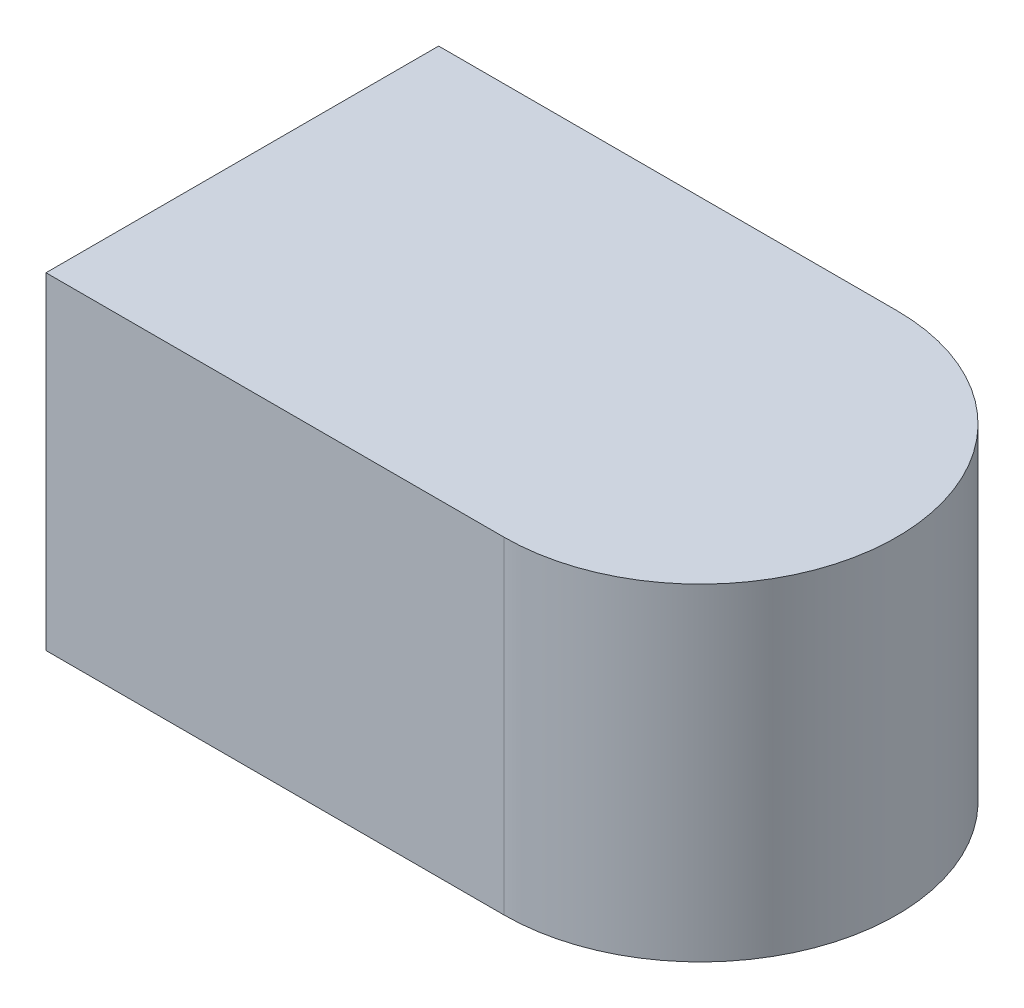
ISO-10303-21;
HEADER;
FILE_DESCRIPTION(('STEP AP214'),'2;1');
FILE_NAME('part.step','',(''),(''),'','','');
FILE_SCHEMA(('AUTOMOTIVE_DESIGN { 1 0 10303 214 1 1 1 1 }'));
ENDSEC;
DATA;
#1=APPLICATION_CONTEXT('core data for automotive mechanical design processes');
#2=APPLICATION_PROTOCOL_DEFINITION('international standard','automotive_design',2000,#1);
#3=PRODUCT_CONTEXT('',#1,'mechanical');
#4=PRODUCT('Part','Part','',(#3));
#5=PRODUCT_RELATED_PRODUCT_CATEGORY('part','',(#4));
#6=PRODUCT_DEFINITION_FORMATION('','',#4);
#7=PRODUCT_DEFINITION_CONTEXT('part definition',#1,'design');
#8=PRODUCT_DEFINITION('design','',#6,#7);
#9=PRODUCT_DEFINITION_SHAPE('','',#8);
#10=(LENGTH_UNIT() NAMED_UNIT(*) SI_UNIT(.MILLI.,.METRE.));
#11=(NAMED_UNIT(*) PLANE_ANGLE_UNIT() SI_UNIT($,.RADIAN.));
#12=(NAMED_UNIT(*) SI_UNIT($,.STERADIAN.) SOLID_ANGLE_UNIT());
#13=UNCERTAINTY_MEASURE_WITH_UNIT(LENGTH_MEASURE(1.E-05),#10,'distance_accuracy_value','');
#14=(GEOMETRIC_REPRESENTATION_CONTEXT(3) GLOBAL_UNCERTAINTY_ASSIGNED_CONTEXT((#13)) GLOBAL_UNIT_ASSIGNED_CONTEXT((#10,
#11,#12)) REPRESENTATION_CONTEXT('',''));
#15=CARTESIAN_POINT('',(0.,0.,0.));
#16=DIRECTION('',(0.,0.,1.));
#17=DIRECTION('',(1.,0.,0.));
#18=AXIS2_PLACEMENT_3D('',#15,#16,#17);
#19=CARTESIAN_POINT('',(0.,0.,0.));
#20=DIRECTION('',(0.,-1.,0.));
#21=DIRECTION('',(-1.,0.,0.));
#22=AXIS2_PLACEMENT_3D('',#19,#20,#21);
#23=PLANE('',#22);
#24=CARTESIAN_POINT('',(-1.47,0.,-0.75));
#25=DIRECTION('',(0.,-1.,0.));
#26=DIRECTION('',(0.,0.,-1.));
#27=AXIS2_PLACEMENT_3D('',#24,#25,#26);
#28=CIRCLE('',#27,0.12);
#29=CARTESIAN_POINT('',(-1.47,0.,-0.87));
#30=VERTEX_POINT('',#29);
#31=CARTESIAN_POINT('',(-1.47,0.,-0.63));
#32=VERTEX_POINT('',#31);
#33=EDGE_CURVE('E11',#30,#32,#28,.T.);
#34=ORIENTED_EDGE('',*,*,#33,.T.);
#35=DIRECTION('',(-1.,0.,0.));
#36=VECTOR('',#35,1.);
#37=CARTESIAN_POINT('',(-1.47,0.,-0.63));
#38=LINE('',#37,#36);
#39=CARTESIAN_POINT('',(-1.75,0.,-0.63));
#40=VERTEX_POINT('',#39);
#41=EDGE_CURVE('E24',#32,#40,#38,.T.);
#42=ORIENTED_EDGE('',*,*,#41,.T.);
#43=DIRECTION('',(0.,0.,-1.));
#44=VECTOR('',#43,1.);
#45=CARTESIAN_POINT('',(-1.75,0.,-0.63));
#46=LINE('',#45,#44);
#47=CARTESIAN_POINT('',(-1.75,0.,-0.87));
#48=VERTEX_POINT('',#47);
#49=EDGE_CURVE('E62',#40,#48,#46,.T.);
#50=ORIENTED_EDGE('',*,*,#49,.T.);
#51=DIRECTION('',(1.,0.,0.));
#52=VECTOR('',#51,1.);
#53=CARTESIAN_POINT('',(-1.75,0.,-0.87));
#54=LINE('',#53,#52);
#55=EDGE_CURVE('E36',#48,#30,#54,.T.);
#56=ORIENTED_EDGE('',*,*,#55,.T.);
#57=EDGE_LOOP('',(#34,#42,#50,#56));
#58=FACE_BOUND('',#57,.T.);
#59=ADVANCED_FACE('F17',(#58),#23,.T.);
#60=CARTESIAN_POINT('',(-1.75,0.,-0.87));
#61=DIRECTION('',(0.,0.,1.));
#62=DIRECTION('',(1.,0.,0.));
#63=AXIS2_PLACEMENT_3D('',#60,#61,#62);
#64=PLANE('',#63);
#65=DIRECTION('',(0.,1.,0.));
#66=VECTOR('',#65,1.);
#67=CARTESIAN_POINT('',(-1.75,0.,-0.87));
#68=LINE('',#67,#66);
#69=CARTESIAN_POINT('',(-1.75,0.2,-0.87));
#70=VERTEX_POINT('',#69);
#71=EDGE_CURVE('E84',#48,#70,#68,.T.);
#72=ORIENTED_EDGE('',*,*,#71,.T.);
#73=DIRECTION('',(1.,0.,0.));
#74=VECTOR('',#73,1.);
#75=CARTESIAN_POINT('',(-1.75,0.2,-0.87));
#76=LINE('',#75,#74);
#77=CARTESIAN_POINT('',(-1.47,0.2,-0.87));
#78=VERTEX_POINT('',#77);
#79=EDGE_CURVE('E74',#70,#78,#76,.T.);
#80=ORIENTED_EDGE('',*,*,#79,.T.);
#81=DIRECTION('',(0.,1.,0.));
#82=VECTOR('',#81,1.);
#83=CARTESIAN_POINT('',(-1.47,0.,-0.87));
#84=LINE('',#83,#82);
#85=EDGE_CURVE('E81',#30,#78,#84,.T.);
#86=ORIENTED_EDGE('',*,*,#85,.F.);
#87=ORIENTED_EDGE('',*,*,#55,.F.);
#88=EDGE_LOOP('',(#72,#80,#86,#87));
#89=FACE_BOUND('',#88,.T.);
#90=ADVANCED_FACE('F91',(#89),#64,.F.);
#91=CARTESIAN_POINT('',(-1.47,0.,-0.75));
#92=DIRECTION('',(0.,-1.,0.));
#93=DIRECTION('',(-1.,0.,0.));
#94=AXIS2_PLACEMENT_3D('',#91,#92,#93);
#95=CYLINDRICAL_SURFACE('',#94,0.12);
#96=ORIENTED_EDGE('',*,*,#85,.T.);
#97=CARTESIAN_POINT('',(-1.47,0.2,-0.75));
#98=DIRECTION('',(0.,-1.,0.));
#99=DIRECTION('',(0.,0.,-1.));
#100=AXIS2_PLACEMENT_3D('',#97,#98,#99);
#101=CIRCLE('',#100,0.12);
#102=CARTESIAN_POINT('',(-1.47,0.2,-0.63));
#103=VERTEX_POINT('',#102);
#104=EDGE_CURVE('E79',#78,#103,#101,.T.);
#105=ORIENTED_EDGE('',*,*,#104,.T.);
#106=DIRECTION('',(0.,1.,0.));
#107=VECTOR('',#106,1.);
#108=CARTESIAN_POINT('',(-1.47,0.,-0.63));
#109=LINE('',#108,#107);
#110=EDGE_CURVE('E68',#32,#103,#109,.T.);
#111=ORIENTED_EDGE('',*,*,#110,.F.);
#112=ORIENTED_EDGE('',*,*,#33,.F.);
#113=EDGE_LOOP('',(#96,#105,#111,#112));
#114=FACE_BOUND('',#113,.T.);
#115=ADVANCED_FACE('F89',(#114),#95,.T.);
#116=CARTESIAN_POINT('',(-1.47,0.,-0.63));
#117=DIRECTION('',(0.,0.,-1.));
#118=DIRECTION('',(-1.,0.,0.));
#119=AXIS2_PLACEMENT_3D('',#116,#117,#118);
#120=PLANE('',#119);
#121=ORIENTED_EDGE('',*,*,#110,.T.);
#122=DIRECTION('',(-1.,0.,0.));
#123=VECTOR('',#122,1.);
#124=CARTESIAN_POINT('',(-1.47,0.2,-0.63));
#125=LINE('',#124,#123);
#126=CARTESIAN_POINT('',(-1.75,0.2,-0.63));
#127=VERTEX_POINT('',#126);
#128=EDGE_CURVE('E63',#103,#127,#125,.T.);
#129=ORIENTED_EDGE('',*,*,#128,.T.);
#130=DIRECTION('',(0.,1.,0.));
#131=VECTOR('',#130,1.);
#132=CARTESIAN_POINT('',(-1.75,0.,-0.63));
#133=LINE('',#132,#131);
#134=EDGE_CURVE('E56',#40,#127,#133,.T.);
#135=ORIENTED_EDGE('',*,*,#134,.F.);
#136=ORIENTED_EDGE('',*,*,#41,.F.);
#137=EDGE_LOOP('',(#121,#129,#135,#136));
#138=FACE_BOUND('',#137,.T.);
#139=ADVANCED_FACE('F66',(#138),#120,.F.);
#140=CARTESIAN_POINT('',(-1.75,0.,-0.63));
#141=DIRECTION('',(1.,0.,0.));
#142=DIRECTION('',(0.,0.,-1.));
#143=AXIS2_PLACEMENT_3D('',#140,#141,#142);
#144=PLANE('',#143);
#145=ORIENTED_EDGE('',*,*,#134,.T.);
#146=DIRECTION('',(0.,0.,-1.));
#147=VECTOR('',#146,1.);
#148=CARTESIAN_POINT('',(-1.75,0.2,-0.63));
#149=LINE('',#148,#147);
#150=EDGE_CURVE('E61',#127,#70,#149,.T.);
#151=ORIENTED_EDGE('',*,*,#150,.T.);
#152=ORIENTED_EDGE('',*,*,#71,.F.);
#153=ORIENTED_EDGE('',*,*,#49,.F.);
#154=EDGE_LOOP('',(#145,#151,#152,#153));
#155=FACE_BOUND('',#154,.T.);
#156=ADVANCED_FACE('F58',(#155),#144,.F.);
#157=CARTESIAN_POINT('',(0.,0.2,0.));
#158=DIRECTION('',(0.,-1.,0.));
#159=DIRECTION('',(-1.,0.,0.));
#160=AXIS2_PLACEMENT_3D('',#157,#158,#159);
#161=PLANE('',#160);
#162=ORIENTED_EDGE('',*,*,#150,.F.);
#163=ORIENTED_EDGE('',*,*,#128,.F.);
#164=ORIENTED_EDGE('',*,*,#104,.F.);
#165=ORIENTED_EDGE('',*,*,#79,.F.);
#166=EDGE_LOOP('',(#162,#163,#164,#165));
#167=FACE_BOUND('',#166,.T.);
#168=ADVANCED_FACE('F72',(#167),#161,.F.);
#169=CLOSED_SHELL('',(#59,#90,#115,#139,#156,#168));
#170=MANIFOLD_SOLID_BREP('B1',#169);
#171=ADVANCED_BREP_SHAPE_REPRESENTATION('',(#18,#170),#14);
#172=SHAPE_DEFINITION_REPRESENTATION(#9,#171);
ENDSEC;
END-ISO-10303-21;
